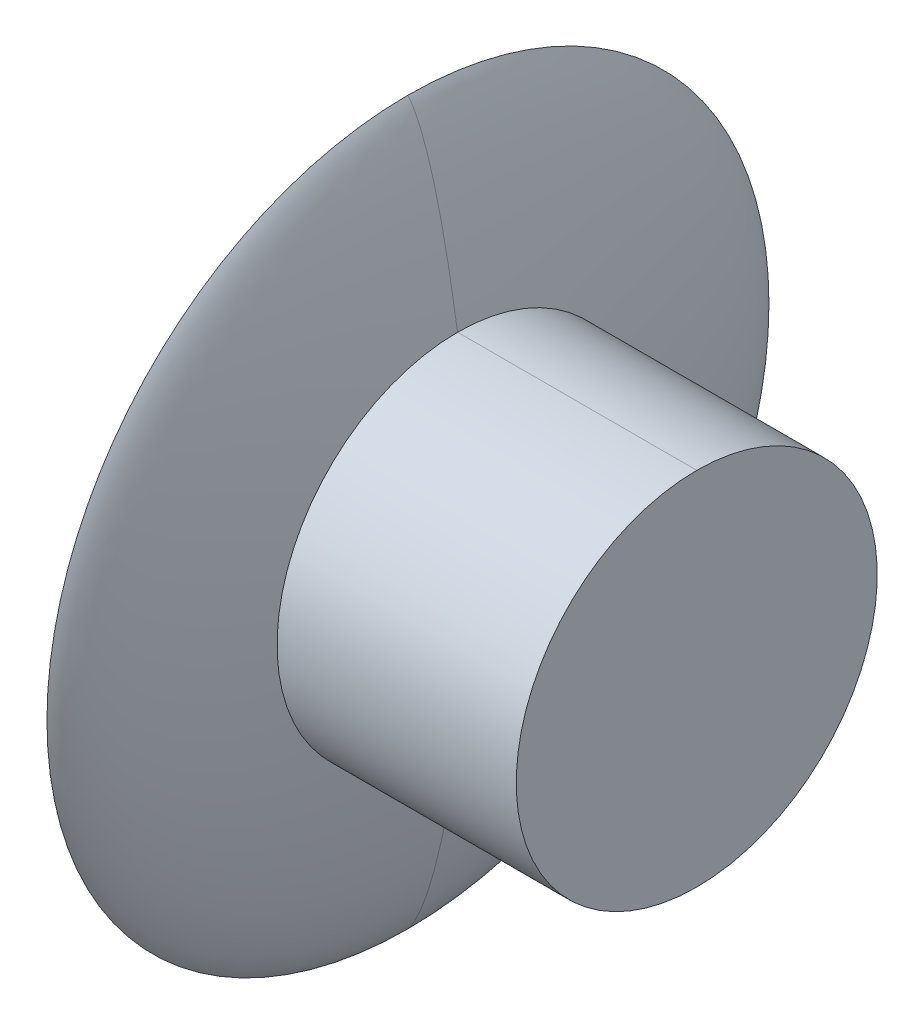
ISO-10303-21;
HEADER;
FILE_DESCRIPTION(('STEP AP214'),'2;1');
FILE_NAME('part.step','',(''),(''),'','','');
FILE_SCHEMA(('AUTOMOTIVE_DESIGN { 1 0 10303 214 1 1 1 1 }'));
ENDSEC;
DATA;
#1=APPLICATION_CONTEXT('core data for automotive mechanical design processes');
#2=APPLICATION_PROTOCOL_DEFINITION('international standard','automotive_design',2000,#1);
#3=PRODUCT_CONTEXT('',#1,'mechanical');
#4=PRODUCT('Part','Part','',(#3));
#5=PRODUCT_RELATED_PRODUCT_CATEGORY('part','',(#4));
#6=PRODUCT_DEFINITION_FORMATION('','',#4);
#7=PRODUCT_DEFINITION_CONTEXT('part definition',#1,'design');
#8=PRODUCT_DEFINITION('design','',#6,#7);
#9=PRODUCT_DEFINITION_SHAPE('','',#8);
#10=(LENGTH_UNIT() NAMED_UNIT(*) SI_UNIT(.MILLI.,.METRE.));
#11=(NAMED_UNIT(*) PLANE_ANGLE_UNIT() SI_UNIT($,.RADIAN.));
#12=(NAMED_UNIT(*) SI_UNIT($,.STERADIAN.) SOLID_ANGLE_UNIT());
#13=UNCERTAINTY_MEASURE_WITH_UNIT(LENGTH_MEASURE(1.E-05),#10,'distance_accuracy_value','');
#14=(GEOMETRIC_REPRESENTATION_CONTEXT(3) GLOBAL_UNCERTAINTY_ASSIGNED_CONTEXT((#13)) GLOBAL_UNIT_ASSIGNED_CONTEXT((#10,
#11,#12)) REPRESENTATION_CONTEXT('',''));
#15=CARTESIAN_POINT('',(0.,0.,0.));
#16=DIRECTION('',(0.,0.,1.));
#17=DIRECTION('',(1.,0.,0.));
#18=AXIS2_PLACEMENT_3D('',#15,#16,#17);
#19=CARTESIAN_POINT('',(20.,0.,0.));
#20=DIRECTION('',(-1.,0.,0.));
#21=DIRECTION('',(0.,0.,1.));
#22=AXIS2_PLACEMENT_3D('',#19,#20,#21);
#23=PLANE('',#22);
#24=CARTESIAN_POINT('',(20.,0.,0.));
#25=DIRECTION('',(-1.,0.,0.));
#26=DIRECTION('',(0.,-1.,0.));
#27=AXIS2_PLACEMENT_3D('',#24,#25,#26);
#28=CIRCLE('',#27,12.5);
#29=CARTESIAN_POINT('',(20.,-12.5,0.));
#30=VERTEX_POINT('',#29);
#31=CARTESIAN_POINT('',(20.,12.5,0.));
#32=VERTEX_POINT('',#31);
#33=EDGE_CURVE('E41',#30,#32,#28,.T.);
#34=ORIENTED_EDGE('',*,*,#33,.F.);
#35=CARTESIAN_POINT('',(20.,0.,0.));
#36=DIRECTION('',(-1.,0.,0.));
#37=DIRECTION('',(0.,1.,0.));
#38=AXIS2_PLACEMENT_3D('',#35,#36,#37);
#39=CIRCLE('',#38,12.5);
#40=EDGE_CURVE('E123',#32,#30,#39,.T.);
#41=ORIENTED_EDGE('',*,*,#40,.F.);
#42=EDGE_LOOP('',(#34,#41));
#43=FACE_BOUND('',#42,.T.);
#44=ADVANCED_FACE('F16',(#43),#23,.F.);
#45=CARTESIAN_POINT('',(0.,0.,0.));
#46=DIRECTION('',(-1.,0.,0.));
#47=DIRECTION('',(0.,0.,1.));
#48=AXIS2_PLACEMENT_3D('',#45,#46,#47);
#49=PLANE('',#48);
#50=CARTESIAN_POINT('',(0.000163258266255677,0.,0.));
#51=DIRECTION('',(1.,0.,0.));
#52=DIRECTION('',(0.,-1.,0.));
#53=AXIS2_PLACEMENT_3D('',#50,#51,#52);
#54=CIRCLE('',#53,25.0001315845538);
#55=CARTESIAN_POINT('',(0.,25.,0.));
#56=VERTEX_POINT('',#55);
#57=CARTESIAN_POINT('',(0.,-25.,0.));
#58=VERTEX_POINT('',#57);
#59=EDGE_CURVE('E78',#56,#58,#54,.F.);
#60=ORIENTED_EDGE('',*,*,#59,.T.);
#61=CARTESIAN_POINT('',(0.000163258266255677,0.,0.));
#62=DIRECTION('',(1.,0.,0.));
#63=DIRECTION('',(0.,1.,0.));
#64=AXIS2_PLACEMENT_3D('',#61,#62,#63);
#65=CIRCLE('',#64,25.0001315845538);
#66=EDGE_CURVE('E11',#56,#58,#65,.T.);
#67=ORIENTED_EDGE('',*,*,#66,.F.);
#68=EDGE_LOOP('',(#60,#67));
#69=FACE_BOUND('',#68,.T.);
#70=ADVANCED_FACE('F80',(#69),#49,.T.);
#71=CARTESIAN_POINT('',(0.000163258266244963,25.0001315845539,0.));
#72=CARTESIAN_POINT('',(0.151841793587436,24.8119425153897,0.));
#73=CARTESIAN_POINT('',(0.429288264839633,24.3798818228111,0.));
#74=CARTESIAN_POINT('',(0.8981685079073,23.4354344254,0.));
#75=CARTESIAN_POINT('',(1.371061241065,22.15213391658,0.));
#76=CARTESIAN_POINT('',(1.835855953928,20.57007318531,0.));
#77=CARTESIAN_POINT('',(2.365869339644,18.42387420496,0.));
#78=CARTESIAN_POINT('',(2.90661860163786,15.7367803072857,0.));
#79=CARTESIAN_POINT('',(3.26994297886164,13.5678171303558,0.));
#80=CARTESIAN_POINT('',(3.4366627104268,12.500000100471,0.));
#81=(BOUNDED_CURVE() B_SPLINE_CURVE(3,(#71,#72,#73,#74,#75,#76,#77,#78,#79,#80),.UNSPECIFIED.,
.F.,.F.) B_SPLINE_CURVE_WITH_KNOTS((4,1,1,1,1,1,1,4),(0.00953208511807006,0.0625,0.125,0.25,
0.375,0.5,0.75,0.990357019623845),
.UNSPECIFIED.) CURVE() GEOMETRIC_REPRESENTATION_ITEM() RATIONAL_B_SPLINE_CURVE((1.,1.,1.,1.,1.,
1.,1.,1.,1.,1.)) REPRESENTATION_ITEM(''));
#82=CARTESIAN_POINT('',(5.25,0.,0.));
#83=DIRECTION('',(1.,0.,0.));
#84=AXIS1_PLACEMENT('',#82,#83);
#85=SURFACE_OF_REVOLUTION('',#81,#84);
#86=CARTESIAN_POINT('',(3.4366627104268,12.500000100471,0.));
#87=CARTESIAN_POINT('',(3.38810323249333,12.8109972401557,0.));
#88=CARTESIAN_POINT('',(3.33854643712451,13.1218408946329,0.));
#89=CARTESIAN_POINT('',(3.2372557757501,13.7426365238676,0.));
#90=CARTESIAN_POINT('',(3.185525709457,14.0525891191675,0.));
#91=CARTESIAN_POINT('',(3.07964042842883,14.6715038074734,0.));
#92=CARTESIAN_POINT('',(3.02548976834318,14.9804666780705,0.));
#93=CARTESIAN_POINT('',(2.91455600724394,15.5973069842248,0.));
#94=CARTESIAN_POINT('',(2.85777816895073,15.9051853645402,0.));
#95=CARTESIAN_POINT('',(2.74116446862574,16.5196864411559,0.));
#96=CARTESIAN_POINT('',(2.68133536443176,16.8263104154707,0.));
#97=CARTESIAN_POINT('',(2.5580289828638,17.4380698174221,0.));
#98=CARTESIAN_POINT('',(2.49456069615731,17.7432070507121,0.));
#99=CARTESIAN_POINT('',(2.36342961255489,18.3517668914221,0.));
#100=CARTESIAN_POINT('',(2.29577793175635,18.6551918872416,0.));
#101=CARTESIAN_POINT('',(2.15570599723789,19.2600765953992,0.));
#102=CARTESIAN_POINT('',(2.08329918280602,19.5615394064926,0.));
#103=CARTESIAN_POINT('',(1.93248260072018,20.1620168478676,0.));
#104=CARTESIAN_POINT('',(1.85409138754175,20.4610360989095,0.));
#105=CARTESIAN_POINT('',(1.68976523739008,21.0559967182168,0.));
#106=CARTESIAN_POINT('',(1.60385467271356,21.35194478966,0.));
#107=CARTESIAN_POINT('',(1.42270873648348,21.9400559375909,0.));
#108=CARTESIAN_POINT('',(1.32750204511704,22.2322276917477,0.));
#109=CARTESIAN_POINT('',(1.17472131688129,22.666688777228,0.));
#110=CARTESIAN_POINT('',(1.12218593255082,22.8107445892406,0.));
#111=CARTESIAN_POINT('',(1.01278492157971,23.0970971040844,0.));
#112=CARTESIAN_POINT('',(0.955922336450101,23.2393949622561,0.));
#113=CARTESIAN_POINT('',(0.837133786348168,23.5219411151385,0.));
#114=CARTESIAN_POINT('',(0.775206002535465,23.6621886521106,0.));
#115=CARTESIAN_POINT('',(0.677711372951267,23.8705225885186,0.));
#116=CARTESIAN_POINT('',(0.644420693644993,23.9396761138515,0.));
#117=CARTESIAN_POINT('',(0.575964327500565,24.0772192409902,0.));
#118=CARTESIAN_POINT('',(0.540795154064875,24.1456071156495,0.));
#119=CARTESIAN_POINT('',(0.46832471330575,24.281512986,0.));
#120=CARTESIAN_POINT('',(0.431017282735363,24.3490277007534,0.));
#121=CARTESIAN_POINT('',(0.353974090698466,24.4830911565571,0.));
#122=CARTESIAN_POINT('',(0.314227640179728,24.5496337888536,0.));
#123=CARTESIAN_POINT('',(0.231323420313913,24.6813527851298,0.));
#124=CARTESIAN_POINT('',(0.188140229631815,24.7465133633605,0.));
#125=CARTESIAN_POINT('',(0.097460291487955,24.8750840345769,0.));
#126=CARTESIAN_POINT('',(0.0499128090181108,24.9384582039569,0.));
#127=CARTESIAN_POINT('',(0.00016325826625012,25.0001315845538,0.));
#128=B_SPLINE_CURVE_WITH_KNOTS('',3,(#86,#87,#88,#89,#90,#91,#92,#93,#94,#95,#96,#97,#98,#99,
#100,#101,#102,#103,#104,#105,#106,#107,#108,#109,#110,#111,#112,#113,#114,#115,#116,#117,#118,
#119,#120,#121,#122,#123,#124,#125,#126,#127),.UNSPECIFIED.,.F.,.F.,(4,2,2,2,2,2,2,2,2,2,2,2,2,
2,2,2,2,2,2,2,4),(0.,0.944297843950486,1.88700831472641,2.82801404649667,3.76721012779149,
4.70440952075793,5.639385738714,6.57197623729549,7.50203585365448,8.429320615203,
9.35370384678601,10.2753202632146,10.7352764629764,11.1949123020221,11.6547139204903,
11.8849423452174,12.115614034894,12.3469877723509,12.5794601144081,12.8138489358402,
13.0514297622061),.UNSPECIFIED.);
#129=CARTESIAN_POINT('',(3.436662066924,12.5,0.));
#130=VERTEX_POINT('',#129);
#131=EDGE_CURVE('E72',#130,#56,#128,.T.);
#132=ORIENTED_EDGE('',*,*,#131,.T.);
#133=ORIENTED_EDGE('',*,*,#66,.T.);
#134=CARTESIAN_POINT('',(3.4366627104268,-12.500000100471,0.));
#135=CARTESIAN_POINT('',(3.38810323249333,-12.8109972401557,0.));
#136=CARTESIAN_POINT('',(3.33854643712451,-13.1218408946329,0.));
#137=CARTESIAN_POINT('',(3.2372557757501,-13.7426365238676,0.));
#138=CARTESIAN_POINT('',(3.185525709457,-14.0525891191675,0.));
#139=CARTESIAN_POINT('',(3.07964042842883,-14.6715038074734,0.));
#140=CARTESIAN_POINT('',(3.02548976834318,-14.9804666780705,0.));
#141=CARTESIAN_POINT('',(2.91455600724394,-15.5973069842248,0.));
#142=CARTESIAN_POINT('',(2.85777816895073,-15.9051853645402,0.));
#143=CARTESIAN_POINT('',(2.74116446862574,-16.5196864411559,0.));
#144=CARTESIAN_POINT('',(2.68133536443176,-16.8263104154707,0.));
#145=CARTESIAN_POINT('',(2.5580289828638,-17.4380698174221,0.));
#146=CARTESIAN_POINT('',(2.49456069615731,-17.7432070507121,0.));
#147=CARTESIAN_POINT('',(2.36342961255489,-18.3517668914221,0.));
#148=CARTESIAN_POINT('',(2.29577793175635,-18.6551918872416,0.));
#149=CARTESIAN_POINT('',(2.15570599723789,-19.2600765953992,0.));
#150=CARTESIAN_POINT('',(2.08329918280602,-19.5615394064926,0.));
#151=CARTESIAN_POINT('',(1.93248260072018,-20.1620168478676,0.));
#152=CARTESIAN_POINT('',(1.85409138754175,-20.4610360989095,0.));
#153=CARTESIAN_POINT('',(1.68976523739008,-21.0559967182168,0.));
#154=CARTESIAN_POINT('',(1.60385467271356,-21.35194478966,0.));
#155=CARTESIAN_POINT('',(1.42270873648348,-21.9400559375909,0.));
#156=CARTESIAN_POINT('',(1.32750204511704,-22.2322276917477,0.));
#157=CARTESIAN_POINT('',(1.17472131688129,-22.666688777228,0.));
#158=CARTESIAN_POINT('',(1.12218593255083,-22.8107445892406,0.));
#159=CARTESIAN_POINT('',(1.01278492157971,-23.0970971040844,0.));
#160=CARTESIAN_POINT('',(0.9559223364501,-23.2393949622561,0.));
#161=CARTESIAN_POINT('',(0.837133786348167,-23.5219411151385,0.));
#162=CARTESIAN_POINT('',(0.775206002535466,-23.6621886521106,0.));
#163=CARTESIAN_POINT('',(0.677711372951268,-23.8705225885186,0.));
#164=CARTESIAN_POINT('',(0.644420693644994,-23.9396761138515,0.));
#165=CARTESIAN_POINT('',(0.575964327500566,-24.0772192409902,0.));
#166=CARTESIAN_POINT('',(0.540795154064875,-24.1456071156495,0.));
#167=CARTESIAN_POINT('',(0.468324713305749,-24.281512986,0.));
#168=CARTESIAN_POINT('',(0.431017282735363,-24.3490277007534,0.));
#169=CARTESIAN_POINT('',(0.353974090698466,-24.4830911565571,0.));
#170=CARTESIAN_POINT('',(0.314227640179728,-24.5496337888536,0.));
#171=CARTESIAN_POINT('',(0.231323420313913,-24.6813527851298,0.));
#172=CARTESIAN_POINT('',(0.188140229631815,-24.7465133633605,0.));
#173=CARTESIAN_POINT('',(0.0974602914879557,-24.8750840345769,0.));
#174=CARTESIAN_POINT('',(0.0499128090181116,-24.9384582039569,0.));
#175=CARTESIAN_POINT('',(0.000163258266250825,-25.0001315845538,0.));
#176=B_SPLINE_CURVE_WITH_KNOTS('',3,(#134,#135,#136,#137,#138,#139,#140,#141,#142,#143,#144,
#145,#146,#147,#148,#149,#150,#151,#152,#153,#154,#155,#156,#157,#158,#159,#160,#161,#162,#163,
#164,#165,#166,#167,#168,#169,#170,#171,#172,#173,#174,#175),.UNSPECIFIED.,.F.,.F.,(4,2,2,2,2,2,
2,2,2,2,2,2,2,2,2,2,2,2,2,2,4),(0.,0.944297843950486,1.88700831472641,2.82801404649667,
3.76721012779149,4.70440952075793,5.639385738714,6.57197623729549,7.50203585365448,
8.429320615203,9.35370384678601,10.2753202632146,10.7352764629764,11.1949123020221,
11.6547139204903,11.8849423452174,12.115614034894,12.346987772351,12.5794601144081,
12.8138489358402,13.0514297622061),.UNSPECIFIED.);
#177=CARTESIAN_POINT('',(3.436662066924,-12.5,0.));
#178=VERTEX_POINT('',#177);
#179=EDGE_CURVE('E69',#178,#58,#176,.T.);
#180=ORIENTED_EDGE('',*,*,#179,.F.);
#181=CARTESIAN_POINT('',(3.436662066924,0.,0.));
#182=DIRECTION('',(1.,0.,0.));
#183=DIRECTION('',(0.,1.,0.));
#184=AXIS2_PLACEMENT_3D('',#181,#182,#183);
#185=CIRCLE('',#184,12.5);
#186=EDGE_CURVE('E29',#130,#178,#185,.T.);
#187=ORIENTED_EDGE('',*,*,#186,.F.);
#188=EDGE_LOOP('',(#132,#133,#180,#187));
#189=FACE_BOUND('',#188,.T.);
#190=ADVANCED_FACE('F67',(#189),#85,.T.);
#191=CARTESIAN_POINT('',(0.,0.,0.));
#192=DIRECTION('',(-1.,0.,0.));
#193=DIRECTION('',(0.,1.,0.));
#194=AXIS2_PLACEMENT_3D('',#191,#192,#193);
#195=CYLINDRICAL_SURFACE('',#194,12.5);
#196=DIRECTION('',(1.,0.,0.));
#197=VECTOR('',#196,1.);
#198=CARTESIAN_POINT('',(3.436662066924,-12.5,0.));
#199=LINE('',#198,#197);
#200=EDGE_CURVE('E105',#178,#30,#199,.T.);
#201=ORIENTED_EDGE('',*,*,#200,.T.);
#202=ORIENTED_EDGE('',*,*,#33,.T.);
#203=DIRECTION('',(1.,0.,0.));
#204=VECTOR('',#203,1.);
#205=CARTESIAN_POINT('',(3.436662066924,12.5,0.));
#206=LINE('',#205,#204);
#207=EDGE_CURVE('E136',#130,#32,#206,.T.);
#208=ORIENTED_EDGE('',*,*,#207,.F.);
#209=ORIENTED_EDGE('',*,*,#186,.T.);
#210=EDGE_LOOP('',(#201,#202,#208,#209));
#211=FACE_BOUND('',#210,.T.);
#212=ADVANCED_FACE('F115',(#211),#195,.T.);
#213=CARTESIAN_POINT('',(0.,0.,0.));
#214=DIRECTION('',(-1.,0.,0.));
#215=DIRECTION('',(0.,1.,0.));
#216=AXIS2_PLACEMENT_3D('',#213,#214,#215);
#217=CYLINDRICAL_SURFACE('',#216,12.5);
#218=ORIENTED_EDGE('',*,*,#207,.T.);
#219=ORIENTED_EDGE('',*,*,#40,.T.);
#220=ORIENTED_EDGE('',*,*,#200,.F.);
#221=CARTESIAN_POINT('',(3.436662066924,0.,0.));
#222=DIRECTION('',(1.,0.,0.));
#223=DIRECTION('',(0.,-1.,0.));
#224=AXIS2_PLACEMENT_3D('',#221,#222,#223);
#225=CIRCLE('',#224,12.5);
#226=EDGE_CURVE('E89',#178,#130,#225,.T.);
#227=ORIENTED_EDGE('',*,*,#226,.T.);
#228=EDGE_LOOP('',(#218,#219,#220,#227));
#229=FACE_BOUND('',#228,.T.);
#230=ADVANCED_FACE('F146',(#229),#217,.T.);
#231=CARTESIAN_POINT('',(0.000163258266244963,25.0001315845539,0.));
#232=CARTESIAN_POINT('',(0.151841793587436,24.8119425153897,0.));
#233=CARTESIAN_POINT('',(0.429288264839633,24.3798818228111,0.));
#234=CARTESIAN_POINT('',(0.8981685079073,23.4354344254,0.));
#235=CARTESIAN_POINT('',(1.371061241065,22.15213391658,0.));
#236=CARTESIAN_POINT('',(1.835855953928,20.57007318531,0.));
#237=CARTESIAN_POINT('',(2.365869339644,18.42387420496,0.));
#238=CARTESIAN_POINT('',(2.90661860163786,15.7367803072857,0.));
#239=CARTESIAN_POINT('',(3.26994297886164,13.5678171303558,0.));
#240=CARTESIAN_POINT('',(3.4366627104268,12.500000100471,0.));
#241=(BOUNDED_CURVE() B_SPLINE_CURVE(3,(#231,#232,#233,#234,#235,#236,#237,#238,#239,#240),
.UNSPECIFIED.,.F.,.F.) B_SPLINE_CURVE_WITH_KNOTS((4,1,1,1,1,1,1,4),(0.00953208511807006,0.0625,
0.125,0.25,0.375,0.5,0.75,0.990357019623845),
.UNSPECIFIED.) CURVE() GEOMETRIC_REPRESENTATION_ITEM() RATIONAL_B_SPLINE_CURVE((1.,1.,1.,1.,1.,
1.,1.,1.,1.,1.)) REPRESENTATION_ITEM(''));
#242=CARTESIAN_POINT('',(5.25,0.,0.));
#243=DIRECTION('',(1.,0.,0.));
#244=AXIS1_PLACEMENT('',#242,#243);
#245=SURFACE_OF_REVOLUTION('',#241,#244);
#246=ORIENTED_EDGE('',*,*,#179,.T.);
#247=ORIENTED_EDGE('',*,*,#59,.F.);
#248=ORIENTED_EDGE('',*,*,#131,.F.);
#249=ORIENTED_EDGE('',*,*,#226,.F.);
#250=EDGE_LOOP('',(#246,#247,#248,#249));
#251=FACE_BOUND('',#250,.T.);
#252=ADVANCED_FACE('F18',(#251),#245,.T.);
#253=CLOSED_SHELL('',(#44,#70,#190,#212,#230,#252));
#254=MANIFOLD_SOLID_BREP('B1',#253);
#255=ADVANCED_BREP_SHAPE_REPRESENTATION('',(#18,#254),#14);
#256=SHAPE_DEFINITION_REPRESENTATION(#9,#255);
ENDSEC;
END-ISO-10303-21;
